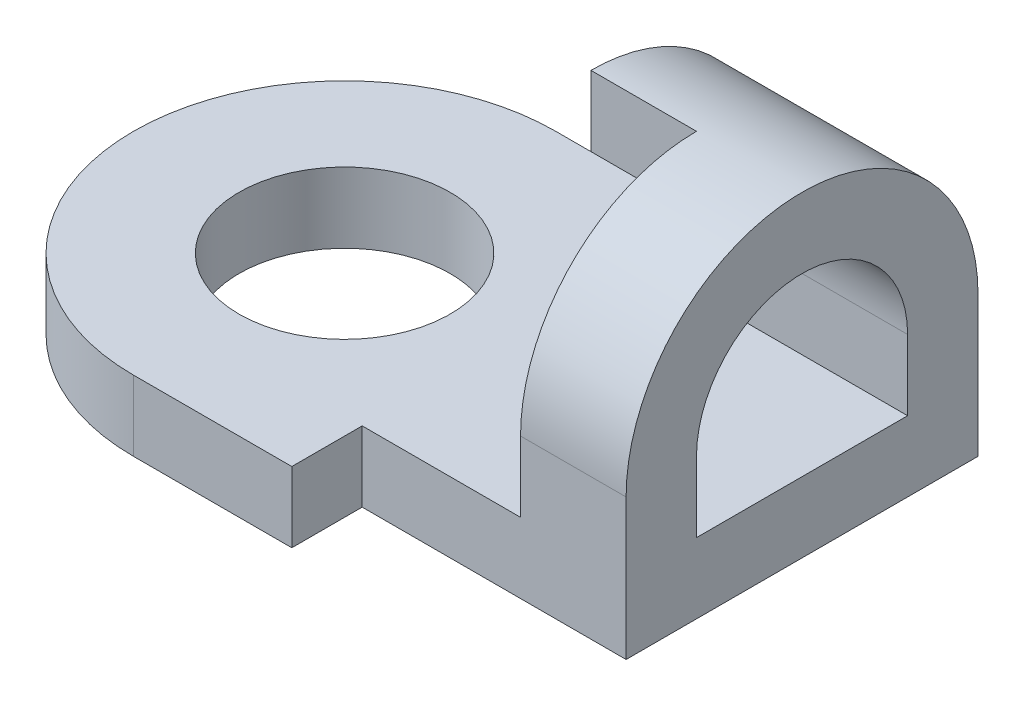
ISO-10303-21;
HEADER;
FILE_DESCRIPTION(('STEP AP214'),'2;1');
FILE_NAME('part.step','',(''),(''),'','','');
FILE_SCHEMA(('AUTOMOTIVE_DESIGN { 1 0 10303 214 1 1 1 1 }'));
ENDSEC;
DATA;
#1=APPLICATION_CONTEXT('core data for automotive mechanical design processes');
#2=APPLICATION_PROTOCOL_DEFINITION('international standard','automotive_design',2000,#1);
#3=PRODUCT_CONTEXT('',#1,'mechanical');
#4=PRODUCT('Part','Part','',(#3));
#5=PRODUCT_RELATED_PRODUCT_CATEGORY('part','',(#4));
#6=PRODUCT_DEFINITION_FORMATION('','',#4);
#7=PRODUCT_DEFINITION_CONTEXT('part definition',#1,'design');
#8=PRODUCT_DEFINITION('design','',#6,#7);
#9=PRODUCT_DEFINITION_SHAPE('','',#8);
#10=(LENGTH_UNIT() NAMED_UNIT(*) SI_UNIT(.MILLI.,.METRE.));
#11=(NAMED_UNIT(*) PLANE_ANGLE_UNIT() SI_UNIT($,.RADIAN.));
#12=(NAMED_UNIT(*) SI_UNIT($,.STERADIAN.) SOLID_ANGLE_UNIT());
#13=UNCERTAINTY_MEASURE_WITH_UNIT(LENGTH_MEASURE(1.E-05),#10,'distance_accuracy_value','');
#14=(GEOMETRIC_REPRESENTATION_CONTEXT(3) GLOBAL_UNCERTAINTY_ASSIGNED_CONTEXT((#13)) GLOBAL_UNIT_ASSIGNED_CONTEXT((#10,
#11,#12)) REPRESENTATION_CONTEXT('',''));
#15=CARTESIAN_POINT('',(0.,0.,0.));
#16=DIRECTION('',(0.,0.,1.));
#17=DIRECTION('',(1.,0.,0.));
#18=AXIS2_PLACEMENT_3D('',#15,#16,#17);
#19=CARTESIAN_POINT('',(0.,4.,2.));
#20=DIRECTION('',(0.,0.,-1.));
#21=DIRECTION('',(0.,1.,0.));
#22=AXIS2_PLACEMENT_3D('',#19,#20,#21);
#23=PLANE('',#22);
#24=DIRECTION('',(1.,0.,0.));
#25=VECTOR('',#24,1.);
#26=CARTESIAN_POINT('',(0.,2.,2.));
#27=LINE('',#26,#25);
#28=CARTESIAN_POINT('',(3.,2.,2.));
#29=VERTEX_POINT('',#28);
#30=CARTESIAN_POINT('',(6.,2.,2.));
#31=VERTEX_POINT('',#30);
#32=EDGE_CURVE('E201',#29,#31,#27,.T.);
#33=ORIENTED_EDGE('',*,*,#32,.F.);
#34=DIRECTION('',(0.,1.,0.));
#35=VECTOR('',#34,1.);
#36=CARTESIAN_POINT('',(3.,4.,2.));
#37=LINE('',#36,#35);
#38=CARTESIAN_POINT('',(3.,4.,2.));
#39=VERTEX_POINT('',#38);
#40=EDGE_CURVE('E149',#29,#39,#37,.T.);
#41=ORIENTED_EDGE('',*,*,#40,.T.);
#42=DIRECTION('',(1.,0.,0.));
#43=VECTOR('',#42,1.);
#44=CARTESIAN_POINT('',(0.,4.,2.));
#45=LINE('',#44,#43);
#46=CARTESIAN_POINT('',(6.,4.,2.));
#47=VERTEX_POINT('',#46);
#48=EDGE_CURVE('E199',#39,#47,#45,.T.);
#49=ORIENTED_EDGE('',*,*,#48,.T.);
#50=DIRECTION('',(0.,1.,0.));
#51=VECTOR('',#50,1.);
#52=CARTESIAN_POINT('',(6.,4.,2.));
#53=LINE('',#52,#51);
#54=EDGE_CURVE('E187',#31,#47,#53,.T.);
#55=ORIENTED_EDGE('',*,*,#54,.F.);
#56=EDGE_LOOP('',(#33,#41,#49,#55));
#57=FACE_BOUND('',#56,.T.);
#58=ADVANCED_FACE('F35',(#57),#23,.T.);
#59=CARTESIAN_POINT('',(0.,2.,-6.));
#60=DIRECTION('',(0.,0.,-1.));
#61=DIRECTION('',(-1.,0.,0.));
#62=AXIS2_PLACEMENT_3D('',#59,#60,#61);
#63=PLANE('',#62);
#64=DIRECTION('',(1.,0.,0.));
#65=VECTOR('',#64,1.);
#66=CARTESIAN_POINT('',(0.,0.,-6.));
#67=LINE('',#66,#65);
#68=CARTESIAN_POINT('',(-6.,0.,-6.));
#69=VERTEX_POINT('',#68);
#70=CARTESIAN_POINT('',(6.,0.,-6.));
#71=VERTEX_POINT('',#70);
#72=EDGE_CURVE('E196',#69,#71,#67,.T.);
#73=ORIENTED_EDGE('',*,*,#72,.F.);
#74=DIRECTION('',(0.,-1.,0.));
#75=VECTOR('',#74,1.);
#76=CARTESIAN_POINT('',(-6.,2.,-6.));
#77=LINE('',#76,#75);
#78=CARTESIAN_POINT('',(-6.,2.,-6.));
#79=VERTEX_POINT('',#78);
#80=EDGE_CURVE('E43',#79,#69,#77,.T.);
#81=ORIENTED_EDGE('',*,*,#80,.F.);
#82=DIRECTION('',(1.,0.,0.));
#83=VECTOR('',#82,1.);
#84=CARTESIAN_POINT('',(0.,2.,-6.));
#85=LINE('',#84,#83);
#86=CARTESIAN_POINT('',(0.,2.,-6.));
#87=VERTEX_POINT('',#86);
#88=EDGE_CURVE('E206',#79,#87,#85,.T.);
#89=ORIENTED_EDGE('',*,*,#88,.T.);
#90=DIRECTION('',(0.,1.,0.));
#91=VECTOR('',#90,1.);
#92=CARTESIAN_POINT('',(0.,4.,-6.));
#93=LINE('',#92,#91);
#94=CARTESIAN_POINT('',(0.,4.,-6.));
#95=VERTEX_POINT('',#94);
#96=EDGE_CURVE('E172',#87,#95,#93,.T.);
#97=ORIENTED_EDGE('',*,*,#96,.T.);
#98=DIRECTION('',(1.,0.,0.));
#99=VECTOR('',#98,1.);
#100=CARTESIAN_POINT('',(0.,4.,-6.));
#101=LINE('',#100,#99);
#102=CARTESIAN_POINT('',(6.,4.,-6.));
#103=VERTEX_POINT('',#102);
#104=EDGE_CURVE('E184',#95,#103,#101,.T.);
#105=ORIENTED_EDGE('',*,*,#104,.T.);
#106=DIRECTION('',(0.,-1.,0.));
#107=VECTOR('',#106,1.);
#108=CARTESIAN_POINT('',(6.,2.,-6.));
#109=LINE('',#108,#107);
#110=EDGE_CURVE('E219',#103,#71,#109,.T.);
#111=ORIENTED_EDGE('',*,*,#110,.T.);
#112=EDGE_LOOP('',(#73,#81,#89,#97,#105,#111));
#113=FACE_BOUND('',#112,.T.);
#114=ADVANCED_FACE('F37',(#113),#63,.T.);
#115=CARTESIAN_POINT('',(-6.,2.,0.));
#116=DIRECTION('',(0.,-1.,0.));
#117=DIRECTION('',(0.,0.,-1.));
#118=AXIS2_PLACEMENT_3D('',#115,#116,#117);
#119=CYLINDRICAL_SURFACE('',#118,6.);
#120=CARTESIAN_POINT('',(-6.,0.,0.));
#121=DIRECTION('',(0.,1.,0.));
#122=DIRECTION('',(0.,0.,1.));
#123=AXIS2_PLACEMENT_3D('',#120,#121,#122);
#124=CIRCLE('',#123,6.);
#125=CARTESIAN_POINT('',(-6.,0.,6.));
#126=VERTEX_POINT('',#125);
#127=EDGE_CURVE('E222',#69,#126,#124,.T.);
#128=ORIENTED_EDGE('',*,*,#127,.T.);
#129=DIRECTION('',(0.,-1.,0.));
#130=VECTOR('',#129,1.);
#131=CARTESIAN_POINT('',(-6.,2.,6.));
#132=LINE('',#131,#130);
#133=CARTESIAN_POINT('',(-6.,2.,6.));
#134=VERTEX_POINT('',#133);
#135=EDGE_CURVE('E245',#134,#126,#132,.T.);
#136=ORIENTED_EDGE('',*,*,#135,.F.);
#137=CARTESIAN_POINT('',(-6.,2.,0.));
#138=DIRECTION('',(0.,1.,0.));
#139=DIRECTION('',(0.,0.,1.));
#140=AXIS2_PLACEMENT_3D('',#137,#138,#139);
#141=CIRCLE('',#140,6.);
#142=EDGE_CURVE('E209',#79,#134,#141,.T.);
#143=ORIENTED_EDGE('',*,*,#142,.F.);
#144=ORIENTED_EDGE('',*,*,#80,.T.);
#145=EDGE_LOOP('',(#128,#136,#143,#144));
#146=FACE_BOUND('',#145,.T.);
#147=ADVANCED_FACE('F250',(#146),#119,.T.);
#148=CARTESIAN_POINT('',(0.,2.,6.));
#149=DIRECTION('',(0.,0.,-1.));
#150=DIRECTION('',(-1.,0.,0.));
#151=AXIS2_PLACEMENT_3D('',#148,#149,#150);
#152=PLANE('',#151);
#153=DIRECTION('',(1.,0.,0.));
#154=VECTOR('',#153,1.);
#155=CARTESIAN_POINT('',(0.,0.,6.));
#156=LINE('',#155,#154);
#157=CARTESIAN_POINT('',(-1.5,0.,6.));
#158=VERTEX_POINT('',#157);
#159=EDGE_CURVE('E224',#126,#158,#156,.T.);
#160=ORIENTED_EDGE('',*,*,#159,.T.);
#161=DIRECTION('',(0.,-1.,0.));
#162=VECTOR('',#161,1.);
#163=CARTESIAN_POINT('',(-1.5,2.,6.));
#164=LINE('',#163,#162);
#165=CARTESIAN_POINT('',(-1.5,2.,6.));
#166=VERTEX_POINT('',#165);
#167=EDGE_CURVE('E242',#166,#158,#164,.T.);
#168=ORIENTED_EDGE('',*,*,#167,.F.);
#169=DIRECTION('',(1.,0.,0.));
#170=VECTOR('',#169,1.);
#171=CARTESIAN_POINT('',(0.,2.,6.));
#172=LINE('',#171,#170);
#173=EDGE_CURVE('E212',#134,#166,#172,.T.);
#174=ORIENTED_EDGE('',*,*,#173,.F.);
#175=ORIENTED_EDGE('',*,*,#135,.T.);
#176=EDGE_LOOP('',(#160,#168,#174,#175));
#177=FACE_BOUND('',#176,.T.);
#178=ADVANCED_FACE('F270',(#177),#152,.F.);
#179=CARTESIAN_POINT('',(-1.5,2.,0.));
#180=DIRECTION('',(-1.,0.,0.));
#181=DIRECTION('',(0.,0.,1.));
#182=AXIS2_PLACEMENT_3D('',#179,#180,#181);
#183=PLANE('',#182);
#184=DIRECTION('',(0.,0.,-1.));
#185=VECTOR('',#184,1.);
#186=CARTESIAN_POINT('',(-1.5,0.,0.));
#187=LINE('',#186,#185);
#188=CARTESIAN_POINT('',(-1.5,0.,4.));
#189=VERTEX_POINT('',#188);
#190=EDGE_CURVE('E226',#158,#189,#187,.T.);
#191=ORIENTED_EDGE('',*,*,#190,.T.);
#192=DIRECTION('',(0.,-1.,0.));
#193=VECTOR('',#192,1.);
#194=CARTESIAN_POINT('',(-1.5,2.,4.));
#195=LINE('',#194,#193);
#196=CARTESIAN_POINT('',(-1.5,2.,4.));
#197=VERTEX_POINT('',#196);
#198=EDGE_CURVE('E240',#197,#189,#195,.T.);
#199=ORIENTED_EDGE('',*,*,#198,.F.);
#200=DIRECTION('',(0.,0.,-1.));
#201=VECTOR('',#200,1.);
#202=CARTESIAN_POINT('',(-1.5,2.,0.));
#203=LINE('',#202,#201);
#204=EDGE_CURVE('E140',#166,#197,#203,.T.);
#205=ORIENTED_EDGE('',*,*,#204,.F.);
#206=ORIENTED_EDGE('',*,*,#167,.T.);
#207=EDGE_LOOP('',(#191,#199,#205,#206));
#208=FACE_BOUND('',#207,.T.);
#209=ADVANCED_FACE('F266',(#208),#183,.F.);
#210=CARTESIAN_POINT('',(0.,2.,4.));
#211=DIRECTION('',(0.,0.,1.));
#212=DIRECTION('',(1.,0.,0.));
#213=AXIS2_PLACEMENT_3D('',#210,#211,#212);
#214=PLANE('',#213);
#215=DIRECTION('',(0.,1.,0.));
#216=VECTOR('',#215,1.);
#217=CARTESIAN_POINT('',(3.,9.,4.));
#218=LINE('',#217,#216);
#219=CARTESIAN_POINT('',(3.,2.,4.));
#220=VERTEX_POINT('',#219);
#221=CARTESIAN_POINT('',(3.,4.,4.));
#222=VERTEX_POINT('',#221);
#223=EDGE_CURVE('E147',#220,#222,#218,.T.);
#224=ORIENTED_EDGE('',*,*,#223,.F.);
#225=DIRECTION('',(-1.,0.,0.));
#226=VECTOR('',#225,1.);
#227=CARTESIAN_POINT('',(0.,2.,4.));
#228=LINE('',#227,#226);
#229=EDGE_CURVE('E133',#220,#197,#228,.T.);
#230=ORIENTED_EDGE('',*,*,#229,.T.);
#231=ORIENTED_EDGE('',*,*,#198,.T.);
#232=DIRECTION('',(-1.,0.,0.));
#233=VECTOR('',#232,1.);
#234=CARTESIAN_POINT('',(0.,0.,4.));
#235=LINE('',#234,#233);
#236=CARTESIAN_POINT('',(6.,0.,4.));
#237=VERTEX_POINT('',#236);
#238=EDGE_CURVE('E229',#237,#189,#235,.T.);
#239=ORIENTED_EDGE('',*,*,#238,.F.);
#240=DIRECTION('',(0.,-1.,0.));
#241=VECTOR('',#240,1.);
#242=CARTESIAN_POINT('',(6.,2.,4.));
#243=LINE('',#242,#241);
#244=CARTESIAN_POINT('',(6.,4.,4.));
#245=VERTEX_POINT('',#244);
#246=EDGE_CURVE('E238',#245,#237,#243,.T.);
#247=ORIENTED_EDGE('',*,*,#246,.F.);
#248=DIRECTION('',(1.,0.,0.));
#249=VECTOR('',#248,1.);
#250=CARTESIAN_POINT('',(0.,4.,4.));
#251=LINE('',#250,#249);
#252=EDGE_CURVE('E155',#222,#245,#251,.T.);
#253=ORIENTED_EDGE('',*,*,#252,.F.);
#254=EDGE_LOOP('',(#224,#230,#231,#239,#247,#253));
#255=FACE_BOUND('',#254,.T.);
#256=ADVANCED_FACE('F153',(#255),#214,.T.);
#257=CARTESIAN_POINT('',(6.,2.,0.));
#258=DIRECTION('',(-1.,0.,0.));
#259=DIRECTION('',(0.,0.,1.));
#260=AXIS2_PLACEMENT_3D('',#257,#258,#259);
#261=PLANE('',#260);
#262=DIRECTION('',(0.,0.,-1.));
#263=VECTOR('',#262,1.);
#264=CARTESIAN_POINT('',(6.,2.,0.));
#265=LINE('',#264,#263);
#266=CARTESIAN_POINT('',(6.,2.,-4.));
#267=VERTEX_POINT('',#266);
#268=EDGE_CURVE('E55',#31,#267,#265,.T.);
#269=ORIENTED_EDGE('',*,*,#268,.F.);
#270=ORIENTED_EDGE('',*,*,#54,.T.);
#271=CARTESIAN_POINT('',(6.,4.,-1.));
#272=DIRECTION('',(-1.,0.,0.));
#273=DIRECTION('',(0.,0.,-1.));
#274=AXIS2_PLACEMENT_3D('',#271,#272,#273);
#275=CIRCLE('',#274,3.);
#276=CARTESIAN_POINT('',(6.,4.,-4.));
#277=VERTEX_POINT('',#276);
#278=EDGE_CURVE('E190',#47,#277,#275,.T.);
#279=ORIENTED_EDGE('',*,*,#278,.T.);
#280=DIRECTION('',(0.,-1.,0.));
#281=VECTOR('',#280,1.);
#282=CARTESIAN_POINT('',(6.,2.,-4.));
#283=LINE('',#282,#281);
#284=EDGE_CURVE('E173',#277,#267,#283,.T.);
#285=ORIENTED_EDGE('',*,*,#284,.T.);
#286=EDGE_LOOP('',(#269,#270,#279,#285));
#287=FACE_BOUND('',#286,.T.);
#288=DIRECTION('',(0.,0.,-1.));
#289=VECTOR('',#288,1.);
#290=CARTESIAN_POINT('',(6.,0.,0.));
#291=LINE('',#290,#289);
#292=EDGE_CURVE('E232',#237,#71,#291,.T.);
#293=ORIENTED_EDGE('',*,*,#292,.T.);
#294=ORIENTED_EDGE('',*,*,#110,.F.);
#295=CARTESIAN_POINT('',(6.,4.,-1.));
#296=DIRECTION('',(1.,0.,0.));
#297=DIRECTION('',(0.,0.,1.));
#298=AXIS2_PLACEMENT_3D('',#295,#296,#297);
#299=CIRCLE('',#298,5.);
#300=EDGE_CURVE('E169',#103,#245,#299,.T.);
#301=ORIENTED_EDGE('',*,*,#300,.T.);
#302=ORIENTED_EDGE('',*,*,#246,.T.);
#303=EDGE_LOOP('',(#293,#294,#301,#302));
#304=FACE_BOUND('',#303,.T.);
#305=ADVANCED_FACE('F263',(#287,#304),#261,.F.);
#306=CARTESIAN_POINT('',(-6.,2.,0.));
#307=DIRECTION('',(0.,-1.,0.));
#308=DIRECTION('',(0.,0.,-1.));
#309=AXIS2_PLACEMENT_3D('',#306,#307,#308);
#310=CYLINDRICAL_SURFACE('',#309,3.);
#311=CARTESIAN_POINT('',(-6.,2.,0.));
#312=DIRECTION('',(0.,1.,0.));
#313=DIRECTION('',(0.,0.,1.));
#314=AXIS2_PLACEMENT_3D('',#311,#312,#313);
#315=CIRCLE('',#314,3.);
#316=CARTESIAN_POINT('',(-6.,2.,3.));
#317=VERTEX_POINT('',#316);
#318=EDGE_CURVE('E216',#317,#317,#315,.T.);
#319=ORIENTED_EDGE('',*,*,#318,.T.);
#320=EDGE_LOOP('',(#319));
#321=FACE_BOUND('',#320,.T.);
#322=CARTESIAN_POINT('',(-6.,0.,0.));
#323=DIRECTION('',(0.,1.,0.));
#324=DIRECTION('',(0.,0.,1.));
#325=AXIS2_PLACEMENT_3D('',#322,#323,#324);
#326=CIRCLE('',#325,3.);
#327=CARTESIAN_POINT('',(-6.,0.,3.));
#328=VERTEX_POINT('',#327);
#329=EDGE_CURVE('E210',#328,#328,#326,.T.);
#330=ORIENTED_EDGE('',*,*,#329,.F.);
#331=EDGE_LOOP('',(#330));
#332=FACE_BOUND('',#331,.T.);
#333=ADVANCED_FACE('F309',(#321,#332),#310,.F.);
#334=CARTESIAN_POINT('',(0.,2.,0.));
#335=DIRECTION('',(0.,1.,0.));
#336=DIRECTION('',(0.,0.,1.));
#337=AXIS2_PLACEMENT_3D('',#334,#335,#336);
#338=PLANE('',#337);
#339=DIRECTION('',(0.,0.,1.));
#340=VECTOR('',#339,1.);
#341=CARTESIAN_POINT('',(3.,2.,-1.));
#342=LINE('',#341,#340);
#343=EDGE_CURVE('E137',#29,#220,#342,.T.);
#344=ORIENTED_EDGE('',*,*,#343,.F.);
#345=ORIENTED_EDGE('',*,*,#32,.T.);
#346=ORIENTED_EDGE('',*,*,#268,.T.);
#347=DIRECTION('',(1.,0.,0.));
#348=VECTOR('',#347,1.);
#349=CARTESIAN_POINT('',(0.,2.,-4.));
#350=LINE('',#349,#348);
#351=CARTESIAN_POINT('',(0.,2.,-4.));
#352=VERTEX_POINT('',#351);
#353=EDGE_CURVE('E50',#352,#267,#350,.T.);
#354=ORIENTED_EDGE('',*,*,#353,.F.);
#355=DIRECTION('',(0.,0.,-1.));
#356=VECTOR('',#355,1.);
#357=CARTESIAN_POINT('',(0.,2.,-6.));
#358=LINE('',#357,#356);
#359=EDGE_CURVE('E170',#352,#87,#358,.T.);
#360=ORIENTED_EDGE('',*,*,#359,.T.);
#361=ORIENTED_EDGE('',*,*,#88,.F.);
#362=ORIENTED_EDGE('',*,*,#142,.T.);
#363=ORIENTED_EDGE('',*,*,#173,.T.);
#364=ORIENTED_EDGE('',*,*,#204,.T.);
#365=ORIENTED_EDGE('',*,*,#229,.F.);
#366=EDGE_LOOP('',(#344,#345,#346,#354,#360,#361,#362,#363,#364,#365));
#367=FACE_BOUND('',#366,.T.);
#368=ORIENTED_EDGE('',*,*,#318,.F.);
#369=EDGE_LOOP('',(#368));
#370=FACE_BOUND('',#369,.T.);
#371=ADVANCED_FACE('F135',(#367,#370),#338,.T.);
#372=CARTESIAN_POINT('',(0.,0.,0.));
#373=DIRECTION('',(0.,1.,0.));
#374=DIRECTION('',(0.,0.,1.));
#375=AXIS2_PLACEMENT_3D('',#372,#373,#374);
#376=PLANE('',#375);
#377=ORIENTED_EDGE('',*,*,#72,.T.);
#378=ORIENTED_EDGE('',*,*,#292,.F.);
#379=ORIENTED_EDGE('',*,*,#238,.T.);
#380=ORIENTED_EDGE('',*,*,#190,.F.);
#381=ORIENTED_EDGE('',*,*,#159,.F.);
#382=ORIENTED_EDGE('',*,*,#127,.F.);
#383=EDGE_LOOP('',(#377,#378,#379,#380,#381,#382));
#384=FACE_BOUND('',#383,.T.);
#385=ORIENTED_EDGE('',*,*,#329,.T.);
#386=EDGE_LOOP('',(#385));
#387=FACE_BOUND('',#386,.T.);
#388=ADVANCED_FACE('F257',(#384,#387),#376,.F.);
#389=CARTESIAN_POINT('',(0.,2.,-4.));
#390=DIRECTION('',(0.,0.,1.));
#391=DIRECTION('',(1.,0.,0.));
#392=AXIS2_PLACEMENT_3D('',#389,#390,#391);
#393=PLANE('',#392);
#394=ORIENTED_EDGE('',*,*,#284,.F.);
#395=DIRECTION('',(1.,0.,0.));
#396=VECTOR('',#395,1.);
#397=CARTESIAN_POINT('',(0.,4.,-4.));
#398=LINE('',#397,#396);
#399=CARTESIAN_POINT('',(0.,4.,-4.));
#400=VERTEX_POINT('',#399);
#401=EDGE_CURVE('E197',#400,#277,#398,.T.);
#402=ORIENTED_EDGE('',*,*,#401,.F.);
#403=DIRECTION('',(0.,-1.,0.));
#404=VECTOR('',#403,1.);
#405=CARTESIAN_POINT('',(0.,2.,-4.));
#406=LINE('',#405,#404);
#407=EDGE_CURVE('E181',#400,#352,#406,.T.);
#408=ORIENTED_EDGE('',*,*,#407,.T.);
#409=ORIENTED_EDGE('',*,*,#353,.T.);
#410=EDGE_LOOP('',(#394,#402,#408,#409));
#411=FACE_BOUND('',#410,.T.);
#412=ADVANCED_FACE('F292',(#411),#393,.T.);
#413=CARTESIAN_POINT('',(0.,4.,-1.));
#414=DIRECTION('',(1.,0.,0.));
#415=DIRECTION('',(0.,0.,-1.));
#416=AXIS2_PLACEMENT_3D('',#413,#414,#415);
#417=CYLINDRICAL_SURFACE('',#416,3.);
#418=DIRECTION('',(1.,0.,0.));
#419=VECTOR('',#418,1.);
#420=CARTESIAN_POINT('',(0.,7.,-1.));
#421=LINE('',#420,#419);
#422=CARTESIAN_POINT('',(0.,7.,-1.));
#423=VERTEX_POINT('',#422);
#424=CARTESIAN_POINT('',(3.,7.,-1.));
#425=VERTEX_POINT('',#424);
#426=EDGE_CURVE('E158',#423,#425,#421,.T.);
#427=ORIENTED_EDGE('',*,*,#426,.F.);
#428=CARTESIAN_POINT('',(0.,4.,-1.));
#429=DIRECTION('',(-1.,0.,0.));
#430=DIRECTION('',(0.,0.,-1.));
#431=AXIS2_PLACEMENT_3D('',#428,#429,#430);
#432=CIRCLE('',#431,3.);
#433=EDGE_CURVE('E179',#423,#400,#432,.T.);
#434=ORIENTED_EDGE('',*,*,#433,.T.);
#435=ORIENTED_EDGE('',*,*,#401,.T.);
#436=ORIENTED_EDGE('',*,*,#278,.F.);
#437=ORIENTED_EDGE('',*,*,#48,.F.);
#438=CARTESIAN_POINT('',(3.,4.,-1.));
#439=DIRECTION('',(-1.,0.,0.));
#440=DIRECTION('',(0.,0.,1.));
#441=AXIS2_PLACEMENT_3D('',#438,#439,#440);
#442=CIRCLE('',#441,3.);
#443=EDGE_CURVE('E166',#39,#425,#442,.T.);
#444=ORIENTED_EDGE('',*,*,#443,.T.);
#445=EDGE_LOOP('',(#427,#434,#435,#436,#437,#444));
#446=FACE_BOUND('',#445,.T.);
#447=ADVANCED_FACE('F287',(#446),#417,.F.);
#448=CARTESIAN_POINT('',(0.,4.,-1.));
#449=DIRECTION('',(1.,0.,0.));
#450=DIRECTION('',(0.,0.,-1.));
#451=AXIS2_PLACEMENT_3D('',#448,#449,#450);
#452=CYLINDRICAL_SURFACE('',#451,5.);
#453=DIRECTION('',(-1.,0.,0.));
#454=VECTOR('',#453,1.);
#455=CARTESIAN_POINT('',(3.,9.,-1.));
#456=LINE('',#455,#454);
#457=CARTESIAN_POINT('',(3.,9.,-1.));
#458=VERTEX_POINT('',#457);
#459=CARTESIAN_POINT('',(0.,9.,-1.));
#460=VERTEX_POINT('',#459);
#461=EDGE_CURVE('E156',#458,#460,#456,.T.);
#462=ORIENTED_EDGE('',*,*,#461,.F.);
#463=CARTESIAN_POINT('',(3.,4.,-1.));
#464=DIRECTION('',(-1.,0.,0.));
#465=DIRECTION('',(0.,0.,1.));
#466=AXIS2_PLACEMENT_3D('',#463,#464,#465);
#467=CIRCLE('',#466,5.);
#468=EDGE_CURVE('E11',#458,#222,#467,.F.);
#469=ORIENTED_EDGE('',*,*,#468,.T.);
#470=ORIENTED_EDGE('',*,*,#252,.T.);
#471=ORIENTED_EDGE('',*,*,#300,.F.);
#472=ORIENTED_EDGE('',*,*,#104,.F.);
#473=CARTESIAN_POINT('',(0.,4.,-1.));
#474=DIRECTION('',(1.,0.,0.));
#475=DIRECTION('',(0.,0.,1.));
#476=AXIS2_PLACEMENT_3D('',#473,#474,#475);
#477=CIRCLE('',#476,5.);
#478=EDGE_CURVE('E176',#95,#460,#477,.T.);
#479=ORIENTED_EDGE('',*,*,#478,.T.);
#480=EDGE_LOOP('',(#462,#469,#470,#471,#472,#479));
#481=FACE_BOUND('',#480,.T.);
#482=ADVANCED_FACE('F280',(#481),#452,.T.);
#483=CARTESIAN_POINT('',(0.,4.,-1.));
#484=DIRECTION('',(1.,0.,0.));
#485=DIRECTION('',(0.,0.,-1.));
#486=AXIS2_PLACEMENT_3D('',#483,#484,#485);
#487=PLANE('',#486);
#488=ORIENTED_EDGE('',*,*,#433,.F.);
#489=DIRECTION('',(0.,-1.,0.));
#490=VECTOR('',#489,1.);
#491=CARTESIAN_POINT('',(0.,9.,-1.));
#492=LINE('',#491,#490);
#493=EDGE_CURVE('E162',#460,#423,#492,.T.);
#494=ORIENTED_EDGE('',*,*,#493,.F.);
#495=ORIENTED_EDGE('',*,*,#478,.F.);
#496=ORIENTED_EDGE('',*,*,#96,.F.);
#497=ORIENTED_EDGE('',*,*,#359,.F.);
#498=ORIENTED_EDGE('',*,*,#407,.F.);
#499=EDGE_LOOP('',(#488,#494,#495,#496,#497,#498));
#500=FACE_BOUND('',#499,.T.);
#501=ADVANCED_FACE('F275',(#500),#487,.F.);
#502=CARTESIAN_POINT('',(3.,9.,-1.));
#503=DIRECTION('',(0.,0.,-1.));
#504=DIRECTION('',(-1.,0.,0.));
#505=AXIS2_PLACEMENT_3D('',#502,#503,#504);
#506=PLANE('',#505);
#507=ORIENTED_EDGE('',*,*,#426,.T.);
#508=DIRECTION('',(0.,-1.,0.));
#509=VECTOR('',#508,1.);
#510=CARTESIAN_POINT('',(3.,9.,-1.));
#511=LINE('',#510,#509);
#512=EDGE_CURVE('E150',#458,#425,#511,.T.);
#513=ORIENTED_EDGE('',*,*,#512,.F.);
#514=ORIENTED_EDGE('',*,*,#461,.T.);
#515=ORIENTED_EDGE('',*,*,#493,.T.);
#516=EDGE_LOOP('',(#507,#513,#514,#515));
#517=FACE_BOUND('',#516,.T.);
#518=ADVANCED_FACE('F284',(#517),#506,.F.);
#519=CARTESIAN_POINT('',(3.,0.,0.));
#520=DIRECTION('',(-1.,0.,0.));
#521=DIRECTION('',(0.,0.,1.));
#522=AXIS2_PLACEMENT_3D('',#519,#520,#521);
#523=PLANE('',#522);
#524=ORIENTED_EDGE('',*,*,#40,.F.);
#525=ORIENTED_EDGE('',*,*,#343,.T.);
#526=ORIENTED_EDGE('',*,*,#223,.T.);
#527=ORIENTED_EDGE('',*,*,#468,.F.);
#528=ORIENTED_EDGE('',*,*,#512,.T.);
#529=ORIENTED_EDGE('',*,*,#443,.F.);
#530=EDGE_LOOP('',(#524,#525,#526,#527,#528,#529));
#531=FACE_BOUND('',#530,.T.);
#532=ADVANCED_FACE('F146',(#531),#523,.T.);
#533=CLOSED_SHELL('',(#58,#114,#147,#178,#209,#256,#305,#333,#371,#388,#412,#447,#482,#501,#518,#532));
#534=MANIFOLD_SOLID_BREP('B2',#533);
#535=ADVANCED_BREP_SHAPE_REPRESENTATION('',(#18,#534),#14);
#536=SHAPE_DEFINITION_REPRESENTATION(#9,#535);
ENDSEC;
END-ISO-10303-21;
